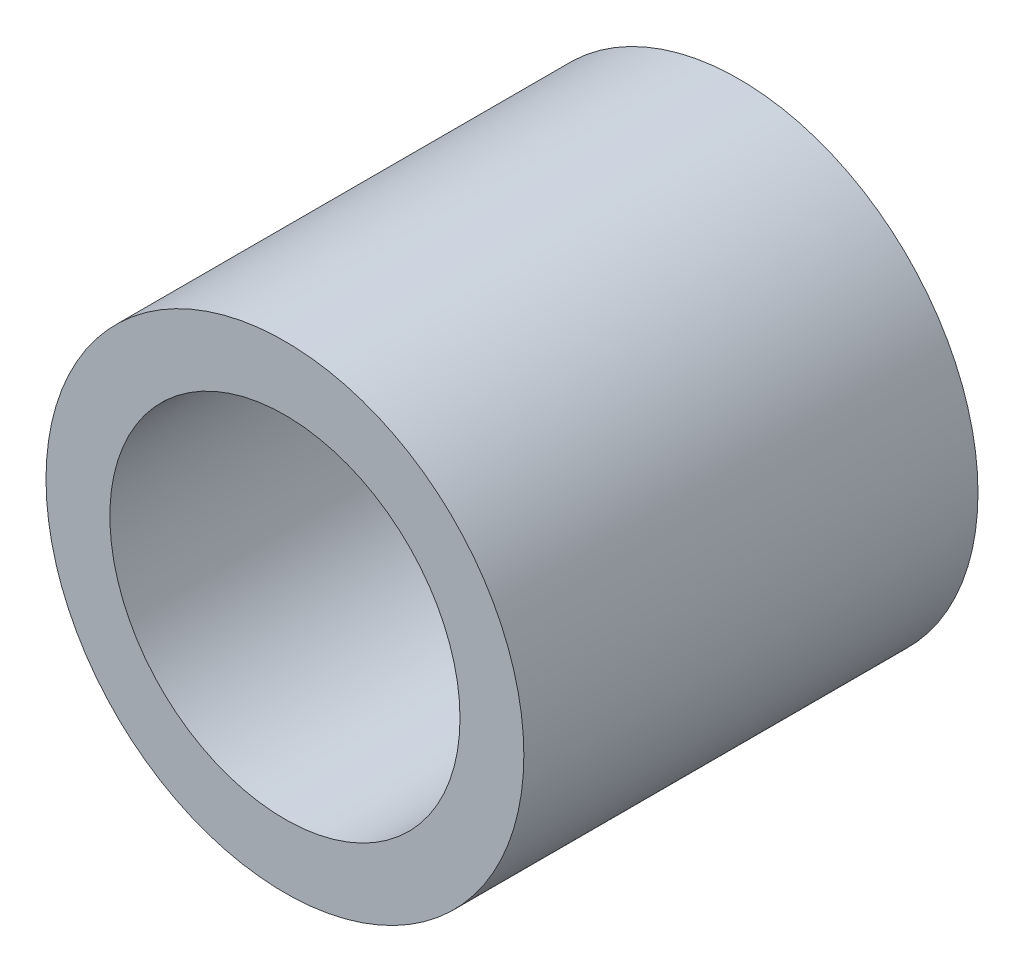
ISO-10303-21;
HEADER;
FILE_DESCRIPTION(('STEP AP214'),'2;1');
FILE_NAME('part.step','',(''),(''),'','','');
FILE_SCHEMA(('AUTOMOTIVE_DESIGN { 1 0 10303 214 1 1 1 1 }'));
ENDSEC;
DATA;
#1=APPLICATION_CONTEXT('core data for automotive mechanical design processes');
#2=APPLICATION_PROTOCOL_DEFINITION('international standard','automotive_design',2000,#1);
#3=PRODUCT_CONTEXT('',#1,'mechanical');
#4=PRODUCT('Part','Part','',(#3));
#5=PRODUCT_RELATED_PRODUCT_CATEGORY('part','',(#4));
#6=PRODUCT_DEFINITION_FORMATION('','',#4);
#7=PRODUCT_DEFINITION_CONTEXT('part definition',#1,'design');
#8=PRODUCT_DEFINITION('design','',#6,#7);
#9=PRODUCT_DEFINITION_SHAPE('','',#8);
#10=(LENGTH_UNIT() NAMED_UNIT(*) SI_UNIT(.MILLI.,.METRE.));
#11=(NAMED_UNIT(*) PLANE_ANGLE_UNIT() SI_UNIT($,.RADIAN.));
#12=(NAMED_UNIT(*) SI_UNIT($,.STERADIAN.) SOLID_ANGLE_UNIT());
#13=UNCERTAINTY_MEASURE_WITH_UNIT(LENGTH_MEASURE(1.E-05),#10,'distance_accuracy_value','');
#14=(GEOMETRIC_REPRESENTATION_CONTEXT(3) GLOBAL_UNCERTAINTY_ASSIGNED_CONTEXT((#13)) GLOBAL_UNIT_ASSIGNED_CONTEXT((#10,
#11,#12)) REPRESENTATION_CONTEXT('',''));
#15=CARTESIAN_POINT('',(0.,0.,0.));
#16=DIRECTION('',(0.,0.,1.));
#17=DIRECTION('',(1.,0.,0.));
#18=AXIS2_PLACEMENT_3D('',#15,#16,#17);
#19=CARTESIAN_POINT('',(0.,0.,-8.763));
#20=DIRECTION('',(0.,0.,1.));
#21=DIRECTION('',(1.,0.,0.));
#22=AXIS2_PLACEMENT_3D('',#19,#20,#21);
#23=CYLINDRICAL_SURFACE('',#22,4.6101);
#24=CARTESIAN_POINT('',(0.,0.,-8.763));
#25=DIRECTION('',(0.,0.,1.));
#26=DIRECTION('',(1.,0.,0.));
#27=AXIS2_PLACEMENT_3D('',#24,#25,#26);
#28=CIRCLE('',#27,4.6101);
#29=CARTESIAN_POINT('',(4.6101,0.,-8.763));
#30=VERTEX_POINT('',#29);
#31=EDGE_CURVE('E10',#30,#30,#28,.T.);
#32=ORIENTED_EDGE('',*,*,#31,.T.);
#33=EDGE_LOOP('',(#32));
#34=FACE_BOUND('',#33,.T.);
#35=CARTESIAN_POINT('',(0.,0.,0.));
#36=DIRECTION('',(0.,0.,1.));
#37=DIRECTION('',(1.,0.,0.));
#38=AXIS2_PLACEMENT_3D('',#35,#36,#37);
#39=CIRCLE('',#38,4.6101);
#40=CARTESIAN_POINT('',(4.6101,0.,0.));
#41=VERTEX_POINT('',#40);
#42=EDGE_CURVE('E41',#41,#41,#39,.T.);
#43=ORIENTED_EDGE('',*,*,#42,.F.);
#44=EDGE_LOOP('',(#43));
#45=FACE_BOUND('',#44,.T.);
#46=ADVANCED_FACE('F38',(#34,#45),#23,.T.);
#47=CARTESIAN_POINT('',(0.,0.,-8.763));
#48=DIRECTION('',(0.,0.,1.));
#49=DIRECTION('',(1.,0.,0.));
#50=AXIS2_PLACEMENT_3D('',#47,#48,#49);
#51=PLANE('',#50);
#52=CARTESIAN_POINT('',(0.,0.,-8.763));
#53=DIRECTION('',(0.,0.,1.));
#54=DIRECTION('',(1.,0.,0.));
#55=AXIS2_PLACEMENT_3D('',#52,#53,#54);
#56=CIRCLE('',#55,3.3782);
#57=CARTESIAN_POINT('',(3.3782,0.,-8.763));
#58=VERTEX_POINT('',#57);
#59=EDGE_CURVE('E51',#58,#58,#56,.T.);
#60=ORIENTED_EDGE('',*,*,#59,.T.);
#61=EDGE_LOOP('',(#60));
#62=FACE_BOUND('',#61,.T.);
#63=ORIENTED_EDGE('',*,*,#31,.F.);
#64=EDGE_LOOP('',(#63));
#65=FACE_BOUND('',#64,.T.);
#66=ADVANCED_FACE('F67',(#62,#65),#51,.F.);
#67=CARTESIAN_POINT('',(0.,0.,0.));
#68=DIRECTION('',(0.,0.,1.));
#69=DIRECTION('',(1.,0.,0.));
#70=AXIS2_PLACEMENT_3D('',#67,#68,#69);
#71=PLANE('',#70);
#72=CARTESIAN_POINT('',(0.,0.,0.));
#73=DIRECTION('',(0.,0.,1.));
#74=DIRECTION('',(1.,0.,0.));
#75=AXIS2_PLACEMENT_3D('',#72,#73,#74);
#76=CIRCLE('',#75,3.3782);
#77=CARTESIAN_POINT('',(3.3782,0.,0.));
#78=VERTEX_POINT('',#77);
#79=EDGE_CURVE('E56',#78,#78,#76,.T.);
#80=ORIENTED_EDGE('',*,*,#79,.F.);
#81=EDGE_LOOP('',(#80));
#82=FACE_BOUND('',#81,.T.);
#83=ORIENTED_EDGE('',*,*,#42,.T.);
#84=EDGE_LOOP('',(#83));
#85=FACE_BOUND('',#84,.T.);
#86=ADVANCED_FACE('F64',(#82,#85),#71,.T.);
#87=CARTESIAN_POINT('',(0.,0.,0.));
#88=DIRECTION('',(0.,0.,1.));
#89=DIRECTION('',(1.,0.,0.));
#90=AXIS2_PLACEMENT_3D('',#87,#88,#89);
#91=CYLINDRICAL_SURFACE('',#90,3.3782);
#92=ORIENTED_EDGE('',*,*,#59,.F.);
#93=EDGE_LOOP('',(#92));
#94=FACE_BOUND('',#93,.T.);
#95=ORIENTED_EDGE('',*,*,#79,.T.);
#96=EDGE_LOOP('',(#95));
#97=FACE_BOUND('',#96,.T.);
#98=ADVANCED_FACE('F62',(#94,#97),#91,.F.);
#99=CLOSED_SHELL('',(#46,#66,#86,#98));
#100=MANIFOLD_SOLID_BREP('B2',#99);
#101=ADVANCED_BREP_SHAPE_REPRESENTATION('',(#18,#100),#14);
#102=SHAPE_DEFINITION_REPRESENTATION(#9,#101);
ENDSEC;
END-ISO-10303-21;
